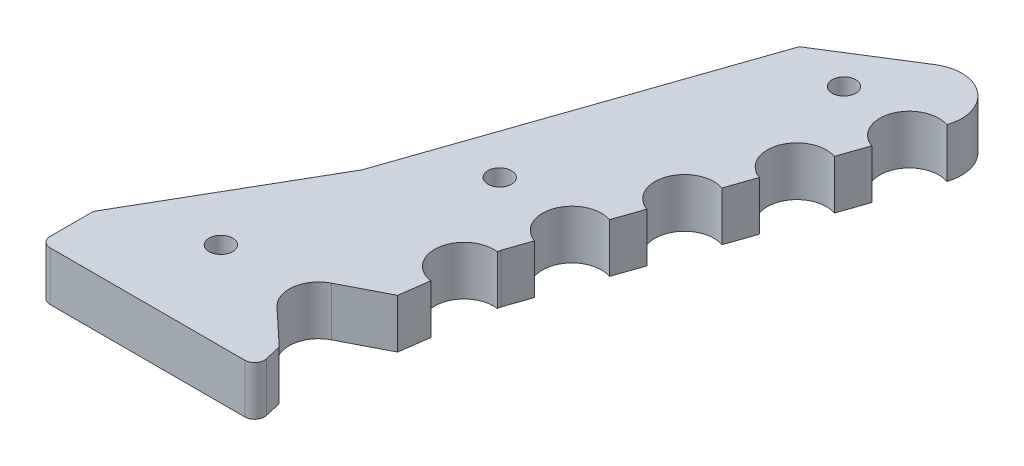
ISO-10303-21;
HEADER;
FILE_DESCRIPTION(('STEP AP214'),'2;1');
FILE_NAME('part.step','',(''),(''),'','','');
FILE_SCHEMA(('AUTOMOTIVE_DESIGN { 1 0 10303 214 1 1 1 1 }'));
ENDSEC;
DATA;
#1=APPLICATION_CONTEXT('core data for automotive mechanical design processes');
#2=APPLICATION_PROTOCOL_DEFINITION('international standard','automotive_design',2000,#1);
#3=PRODUCT_CONTEXT('',#1,'mechanical');
#4=PRODUCT('Part','Part','',(#3));
#5=PRODUCT_RELATED_PRODUCT_CATEGORY('part','',(#4));
#6=PRODUCT_DEFINITION_FORMATION('','',#4);
#7=PRODUCT_DEFINITION_CONTEXT('part definition',#1,'design');
#8=PRODUCT_DEFINITION('design','',#6,#7);
#9=PRODUCT_DEFINITION_SHAPE('','',#8);
#10=(LENGTH_UNIT() NAMED_UNIT(*) SI_UNIT(.MILLI.,.METRE.));
#11=(NAMED_UNIT(*) PLANE_ANGLE_UNIT() SI_UNIT($,.RADIAN.));
#12=(NAMED_UNIT(*) SI_UNIT($,.STERADIAN.) SOLID_ANGLE_UNIT());
#13=UNCERTAINTY_MEASURE_WITH_UNIT(LENGTH_MEASURE(1.E-05),#10,'distance_accuracy_value','');
#14=(GEOMETRIC_REPRESENTATION_CONTEXT(3) GLOBAL_UNCERTAINTY_ASSIGNED_CONTEXT((#13)) GLOBAL_UNIT_ASSIGNED_CONTEXT((#10,
#11,#12)) REPRESENTATION_CONTEXT('',''));
#15=CARTESIAN_POINT('',(0.,0.,0.));
#16=DIRECTION('',(0.,0.,1.));
#17=DIRECTION('',(1.,0.,0.));
#18=AXIS2_PLACEMENT_3D('',#15,#16,#17);
#19=CARTESIAN_POINT('',(24.1578897639016,5.,-47.3205080756888));
#20=DIRECTION('',(-0.990411286938688,0.,-0.138150217895061));
#21=DIRECTION('',(-0.138150217895061,0.,0.990411286938688));
#22=AXIS2_PLACEMENT_3D('',#19,#20,#21);
#23=PLANE('',#22);
#24=DIRECTION('',(0.138150217895061,0.,-0.990411286938688));
#25=VECTOR('',#24,1.);
#26=CARTESIAN_POINT('',(24.1578897639016,0.,-47.3205080756888));
#27=LINE('',#26,#25);
#28=CARTESIAN_POINT('',(22.8683748660811,0.,-38.0758602645134));
#29=VERTEX_POINT('',#28);
#30=CARTESIAN_POINT('',(23.2828255197663,0.,-41.0470941253295));
#31=VERTEX_POINT('',#30);
#32=EDGE_CURVE('E302',#29,#31,#27,.T.);
#33=ORIENTED_EDGE('',*,*,#32,.T.);
#34=DIRECTION('',(0.,1.,0.));
#35=VECTOR('',#34,1.);
#36=CARTESIAN_POINT('',(23.2828255197663,0.,-41.0470941253295));
#37=LINE('',#36,#35);
#38=CARTESIAN_POINT('',(23.2828255197663,5.,-41.0470941253295));
#39=VERTEX_POINT('',#38);
#40=EDGE_CURVE('E352',#31,#39,#37,.T.);
#41=ORIENTED_EDGE('',*,*,#40,.T.);
#42=DIRECTION('',(0.138150217895061,0.,-0.990411286938688));
#43=VECTOR('',#42,1.);
#44=CARTESIAN_POINT('',(24.1578897639016,5.,-47.3205080756888));
#45=LINE('',#44,#43);
#46=CARTESIAN_POINT('',(22.8683748660811,5.,-38.0758602645134));
#47=VERTEX_POINT('',#46);
#48=EDGE_CURVE('E281',#47,#39,#45,.T.);
#49=ORIENTED_EDGE('',*,*,#48,.F.);
#50=DIRECTION('',(0.,1.,0.));
#51=VECTOR('',#50,1.);
#52=CARTESIAN_POINT('',(22.8683748660811,0.,-38.0758602645134));
#53=LINE('',#52,#51);
#54=EDGE_CURVE('E362',#29,#47,#53,.T.);
#55=ORIENTED_EDGE('',*,*,#54,.F.);
#56=EDGE_LOOP('',(#33,#41,#49,#55));
#57=FACE_BOUND('',#56,.T.);
#58=ADVANCED_FACE('F34',(#57),#23,.F.);
#59=CARTESIAN_POINT('',(35.7715563017747,5.,-81.0490447646801));
#60=DIRECTION('',(-0.945518575599318,0.,-0.325568154457154));
#61=DIRECTION('',(-0.325568154457154,0.,0.945518575599318));
#62=AXIS2_PLACEMENT_3D('',#59,#60,#61);
#63=PLANE('',#62);
#64=DIRECTION('',(0.325568154457154,0.,-0.945518575599318));
#65=VECTOR('',#64,1.);
#66=CARTESIAN_POINT('',(35.7715563017747,0.,-81.0490447646801));
#67=LINE('',#66,#65);
#68=CARTESIAN_POINT('',(29.911329521546,0.,-64.0297104038924));
#69=VERTEX_POINT('',#68);
#70=CARTESIAN_POINT('',(30.8880339849174,0.,-66.8662661306903));
#71=VERTEX_POINT('',#70);
#72=EDGE_CURVE('E312',#69,#71,#67,.T.);
#73=ORIENTED_EDGE('',*,*,#72,.T.);
#74=DIRECTION('',(0.,1.,0.));
#75=VECTOR('',#74,1.);
#76=CARTESIAN_POINT('',(30.8880339849174,0.,-66.8662661306903));
#77=LINE('',#76,#75);
#78=CARTESIAN_POINT('',(30.8880339849174,5.,-66.8662661306903));
#79=VERTEX_POINT('',#78);
#80=EDGE_CURVE('E418',#71,#79,#77,.T.);
#81=ORIENTED_EDGE('',*,*,#80,.T.);
#82=DIRECTION('',(0.325568154457154,0.,-0.945518575599318));
#83=VECTOR('',#82,1.);
#84=CARTESIAN_POINT('',(35.7715563017747,5.,-81.0490447646801));
#85=LINE('',#84,#83);
#86=CARTESIAN_POINT('',(29.911329521546,5.,-64.0297104038924));
#87=VERTEX_POINT('',#86);
#88=EDGE_CURVE('E430',#87,#79,#85,.T.);
#89=ORIENTED_EDGE('',*,*,#88,.F.);
#90=DIRECTION('',(0.,1.,0.));
#91=VECTOR('',#90,1.);
#92=CARTESIAN_POINT('',(29.911329521546,0.,-64.0297104038924));
#93=LINE('',#92,#91);
#94=EDGE_CURVE('E337',#69,#87,#93,.T.);
#95=ORIENTED_EDGE('',*,*,#94,.F.);
#96=EDGE_LOOP('',(#73,#81,#89,#95));
#97=FACE_BOUND('',#96,.T.);
#98=ADVANCED_FACE('F458',(#97),#63,.F.);
#99=CARTESIAN_POINT('',(26.9812161314316,0.,-55.5200432234985));
#100=VERTEX_POINT('',#99);
#101=CARTESIAN_POINT('',(27.957920594803,0.,-58.3565989502965));
#102=VERTEX_POINT('',#101);
#103=EDGE_CURVE('E225',#100,#102,#67,.T.);
#104=ORIENTED_EDGE('',*,*,#103,.T.);
#105=DIRECTION('',(0.,1.,0.));
#106=VECTOR('',#105,1.);
#107=CARTESIAN_POINT('',(27.957920594803,0.,-58.3565989502965));
#108=LINE('',#107,#106);
#109=CARTESIAN_POINT('',(27.957920594803,5.,-58.3565989502965));
#110=VERTEX_POINT('',#109);
#111=EDGE_CURVE('E327',#102,#110,#108,.T.);
#112=ORIENTED_EDGE('',*,*,#111,.T.);
#113=CARTESIAN_POINT('',(26.9812161314316,5.,-55.5200432234985));
#114=VERTEX_POINT('',#113);
#115=EDGE_CURVE('E291',#114,#110,#85,.T.);
#116=ORIENTED_EDGE('',*,*,#115,.F.);
#117=DIRECTION('',(0.,1.,0.));
#118=VECTOR('',#117,1.);
#119=CARTESIAN_POINT('',(26.9812161314316,0.,-55.5200432234985));
#120=LINE('',#119,#118);
#121=EDGE_CURVE('E329',#100,#114,#120,.T.);
#122=ORIENTED_EDGE('',*,*,#121,.F.);
#123=EDGE_LOOP('',(#104,#112,#116,#122));
#124=FACE_BOUND('',#123,.T.);
#125=ADVANCED_FACE('F325',(#124),#63,.F.);
#126=CARTESIAN_POINT('',(24.1578897639016,0.,-47.3205080756888));
#127=VERTEX_POINT('',#126);
#128=CARTESIAN_POINT('',(25.0278072046886,0.,-49.8469317699026));
#129=VERTEX_POINT('',#128);
#130=EDGE_CURVE('E219',#127,#129,#67,.T.);
#131=ORIENTED_EDGE('',*,*,#130,.T.);
#132=DIRECTION('',(0.,1.,0.));
#133=VECTOR('',#132,1.);
#134=CARTESIAN_POINT('',(25.0278072046887,0.,-49.8469317699026));
#135=LINE('',#134,#133);
#136=CARTESIAN_POINT('',(25.0278072046887,5.,-49.8469317699026));
#137=VERTEX_POINT('',#136);
#138=EDGE_CURVE('E341',#129,#137,#135,.T.);
#139=ORIENTED_EDGE('',*,*,#138,.T.);
#140=CARTESIAN_POINT('',(24.1578897639016,5.,-47.3205080756888));
#141=VERTEX_POINT('',#140);
#142=EDGE_CURVE('E288',#141,#137,#85,.T.);
#143=ORIENTED_EDGE('',*,*,#142,.F.);
#144=DIRECTION('',(0.,-1.,0.));
#145=VECTOR('',#144,1.);
#146=CARTESIAN_POINT('',(24.1578897639016,5.,-47.3205080756888));
#147=LINE('',#146,#145);
#148=EDGE_CURVE('E210',#141,#127,#147,.T.);
#149=ORIENTED_EDGE('',*,*,#148,.T.);
#150=EDGE_LOOP('',(#131,#139,#143,#149));
#151=FACE_BOUND('',#150,.T.);
#152=ADVANCED_FACE('F441',(#151),#63,.F.);
#153=CARTESIAN_POINT('',(21.3948854060003,5.,-80.4136582216649));
#154=DIRECTION('',(0.532370499844366,0.,0.846511459399966));
#155=DIRECTION('',(0.846511459399966,0.,-0.532370499844366));
#156=AXIS2_PLACEMENT_3D('',#153,#154,#155);
#157=PLANE('',#156);
#158=DIRECTION('',(-0.846511459399966,0.,0.532370499844366));
#159=VECTOR('',#158,1.);
#160=CARTESIAN_POINT('',(21.3948854060003,0.,-80.4136582216649));
#161=LINE('',#160,#159);
#162=CARTESIAN_POINT('',(29.86,0.,-85.7373632201086));
#163=VERTEX_POINT('',#162);
#164=CARTESIAN_POINT('',(21.3948854060003,0.,-80.4136582216649));
#165=VERTEX_POINT('',#164);
#166=EDGE_CURVE('E217',#163,#165,#161,.T.);
#167=ORIENTED_EDGE('',*,*,#166,.T.);
#168=DIRECTION('',(0.,-1.,0.));
#169=VECTOR('',#168,1.);
#170=CARTESIAN_POINT('',(21.3948854060003,5.,-80.4136582216649));
#171=LINE('',#170,#169);
#172=CARTESIAN_POINT('',(21.3948854060003,5.,-80.4136582216649));
#173=VERTEX_POINT('',#172);
#174=EDGE_CURVE('E242',#173,#165,#171,.T.);
#175=ORIENTED_EDGE('',*,*,#174,.F.);
#176=DIRECTION('',(-0.846511459399966,0.,0.532370499844366));
#177=VECTOR('',#176,1.);
#178=CARTESIAN_POINT('',(21.3948854060003,5.,-80.4136582216649));
#179=LINE('',#178,#177);
#180=CARTESIAN_POINT('',(29.86,5.,-85.7373632201086));
#181=VERTEX_POINT('',#180);
#182=EDGE_CURVE('E218',#181,#173,#179,.T.);
#183=ORIENTED_EDGE('',*,*,#182,.F.);
#184=DIRECTION('',(0.,-1.,0.));
#185=VECTOR('',#184,1.);
#186=CARTESIAN_POINT('',(29.86,5.,-85.7373632201086));
#187=LINE('',#186,#185);
#188=EDGE_CURVE('E211',#181,#163,#187,.T.);
#189=ORIENTED_EDGE('',*,*,#188,.T.);
#190=EDGE_LOOP('',(#167,#175,#183,#189));
#191=FACE_BOUND('',#190,.T.);
#192=ADVANCED_FACE('F480',(#191),#157,.F.);
#193=CARTESIAN_POINT('',(9.99999999999996,5.,-47.3205080756888));
#194=DIRECTION('',(0.945518575599318,0.,0.325568154457154));
#195=DIRECTION('',(0.325568154457154,0.,-0.945518575599318));
#196=AXIS2_PLACEMENT_3D('',#193,#194,#195);
#197=PLANE('',#196);
#198=DIRECTION('',(-0.325568154457154,0.,0.945518575599318));
#199=VECTOR('',#198,1.);
#200=CARTESIAN_POINT('',(9.99999999999996,0.,-47.3205080756888));
#201=LINE('',#200,#199);
#202=CARTESIAN_POINT('',(9.99999999999996,0.,-47.3205080756888));
#203=VERTEX_POINT('',#202);
#204=EDGE_CURVE('E295',#165,#203,#201,.T.);
#205=ORIENTED_EDGE('',*,*,#204,.T.);
#206=DIRECTION('',(0.,-1.,0.));
#207=VECTOR('',#206,1.);
#208=CARTESIAN_POINT('',(9.99999999999996,5.,-47.3205080756888));
#209=LINE('',#208,#207);
#210=CARTESIAN_POINT('',(9.99999999999996,5.,-47.3205080756888));
#211=VERTEX_POINT('',#210);
#212=EDGE_CURVE('E239',#211,#203,#209,.T.);
#213=ORIENTED_EDGE('',*,*,#212,.F.);
#214=DIRECTION('',(-0.325568154457154,0.,0.945518575599318));
#215=VECTOR('',#214,1.);
#216=CARTESIAN_POINT('',(9.99999999999996,5.,-47.3205080756888));
#217=LINE('',#216,#215);
#218=EDGE_CURVE('E222',#173,#211,#217,.T.);
#219=ORIENTED_EDGE('',*,*,#218,.F.);
#220=ORIENTED_EDGE('',*,*,#174,.T.);
#221=EDGE_LOOP('',(#205,#213,#219,#220));
#222=FACE_BOUND('',#221,.T.);
#223=ADVANCED_FACE('F477',(#222),#197,.F.);
#224=CARTESIAN_POINT('',(0.,5.,-30.));
#225=DIRECTION('',(0.86602540378444,0.,0.499999999999998));
#226=DIRECTION('',(0.499999999999998,0.,-0.86602540378444));
#227=AXIS2_PLACEMENT_3D('',#224,#225,#226);
#228=PLANE('',#227);
#229=DIRECTION('',(-0.499999999999998,0.,0.86602540378444));
#230=VECTOR('',#229,1.);
#231=CARTESIAN_POINT('',(0.,0.,-30.));
#232=LINE('',#231,#230);
#233=CARTESIAN_POINT('',(0.,0.,-30.));
#234=VERTEX_POINT('',#233);
#235=EDGE_CURVE('E297',#203,#234,#232,.T.);
#236=ORIENTED_EDGE('',*,*,#235,.T.);
#237=DIRECTION('',(0.,-1.,0.));
#238=VECTOR('',#237,1.);
#239=CARTESIAN_POINT('',(0.,5.,-30.));
#240=LINE('',#239,#238);
#241=CARTESIAN_POINT('',(0.,5.,-30.));
#242=VERTEX_POINT('',#241);
#243=EDGE_CURVE('E236',#242,#234,#240,.T.);
#244=ORIENTED_EDGE('',*,*,#243,.F.);
#245=DIRECTION('',(-0.499999999999998,0.,0.86602540378444));
#246=VECTOR('',#245,1.);
#247=CARTESIAN_POINT('',(0.,5.,-30.));
#248=LINE('',#247,#246);
#249=EDGE_CURVE('E284',#211,#242,#248,.T.);
#250=ORIENTED_EDGE('',*,*,#249,.F.);
#251=ORIENTED_EDGE('',*,*,#212,.T.);
#252=EDGE_LOOP('',(#236,#244,#250,#251));
#253=FACE_BOUND('',#252,.T.);
#254=ADVANCED_FACE('F393',(#253),#228,.F.);
#255=CARTESIAN_POINT('',(0.,5.,0.));
#256=DIRECTION('',(1.,0.,0.));
#257=DIRECTION('',(0.,0.,-1.));
#258=AXIS2_PLACEMENT_3D('',#255,#256,#257);
#259=PLANE('',#258);
#260=DIRECTION('',(0.,0.,1.));
#261=VECTOR('',#260,1.);
#262=CARTESIAN_POINT('',(0.,0.,0.));
#263=LINE('',#262,#261);
#264=CARTESIAN_POINT('',(0.,0.,-25.5883219764711));
#265=VERTEX_POINT('',#264);
#266=EDGE_CURVE('E299',#234,#265,#263,.T.);
#267=ORIENTED_EDGE('',*,*,#266,.T.);
#268=DIRECTION('',(0.,1.,0.));
#269=VECTOR('',#268,1.);
#270=CARTESIAN_POINT('',(0.,5.,-25.5883219764711));
#271=LINE('',#270,#269);
#272=CARTESIAN_POINT('',(0.,5.,-25.5883219764711));
#273=VERTEX_POINT('',#272);
#274=EDGE_CURVE('E11',#265,#273,#271,.T.);
#275=ORIENTED_EDGE('',*,*,#274,.T.);
#276=DIRECTION('',(0.,0.,1.));
#277=VECTOR('',#276,1.);
#278=CARTESIAN_POINT('',(0.,5.,0.));
#279=LINE('',#278,#277);
#280=EDGE_CURVE('E279',#242,#273,#279,.T.);
#281=ORIENTED_EDGE('',*,*,#280,.F.);
#282=ORIENTED_EDGE('',*,*,#243,.T.);
#283=EDGE_LOOP('',(#267,#275,#281,#282));
#284=FACE_BOUND('',#283,.T.);
#285=ADVANCED_FACE('F396',(#284),#259,.F.);
#286=CARTESIAN_POINT('',(21.3948854060003,5.,-27.512282336915));
#287=DIRECTION('',(-0.974653453481312,0.,0.223720016129428));
#288=DIRECTION('',(0.223720016129428,0.,0.974653453481312));
#289=AXIS2_PLACEMENT_3D('',#286,#287,#288);
#290=PLANE('',#289);
#291=DIRECTION('',(-0.223720016129428,0.,-0.974653453481312));
#292=VECTOR('',#291,1.);
#293=CARTESIAN_POINT('',(21.3948854060003,5.,-27.512282336915));
#294=LINE('',#293,#292);
#295=CARTESIAN_POINT('',(21.785155194606,5.,-25.8120419926005));
#296=VERTEX_POINT('',#295);
#297=CARTESIAN_POINT('',(21.3948854060003,5.,-27.512282336915));
#298=VERTEX_POINT('',#297);
#299=EDGE_CURVE('E274',#296,#298,#294,.T.);
#300=ORIENTED_EDGE('',*,*,#299,.F.);
#301=DIRECTION('',(0.,1.,0.));
#302=VECTOR('',#301,1.);
#303=CARTESIAN_POINT('',(21.785155194606,5.,-25.8120419926005));
#304=LINE('',#303,#302);
#305=CARTESIAN_POINT('',(21.785155194606,0.,-25.8120419926005));
#306=VERTEX_POINT('',#305);
#307=EDGE_CURVE('E57',#296,#306,#304,.F.);
#308=ORIENTED_EDGE('',*,*,#307,.T.);
#309=DIRECTION('',(-0.223720016129428,0.,-0.974653453481312));
#310=VECTOR('',#309,1.);
#311=CARTESIAN_POINT('',(21.3948854060003,0.,-27.512282336915));
#312=LINE('',#311,#310);
#313=CARTESIAN_POINT('',(21.3948854060003,0.,-27.512282336915));
#314=VERTEX_POINT('',#313);
#315=EDGE_CURVE('E259',#306,#314,#312,.T.);
#316=ORIENTED_EDGE('',*,*,#315,.T.);
#317=DIRECTION('',(0.,-1.,0.));
#318=VECTOR('',#317,1.);
#319=CARTESIAN_POINT('',(21.3948854060003,5.,-27.512282336915));
#320=LINE('',#319,#318);
#321=EDGE_CURVE('E233',#298,#314,#320,.T.);
#322=ORIENTED_EDGE('',*,*,#321,.F.);
#323=EDGE_LOOP('',(#300,#308,#316,#322));
#324=FACE_BOUND('',#323,.T.);
#325=ADVANCED_FACE('F277',(#324),#290,.F.);
#326=CARTESIAN_POINT('',(24.1117268271366,5.,-46.9895618469616));
#327=VERTEX_POINT('',#326);
#328=EDGE_CURVE('E278',#327,#141,#45,.T.);
#329=ORIENTED_EDGE('',*,*,#328,.F.);
#330=DIRECTION('',(0.,1.,0.));
#331=VECTOR('',#330,1.);
#332=CARTESIAN_POINT('',(24.1117268271366,0.,-46.9895618469616));
#333=LINE('',#332,#331);
#334=CARTESIAN_POINT('',(24.1117268271366,0.,-46.9895618469616));
#335=VERTEX_POINT('',#334);
#336=EDGE_CURVE('E359',#335,#327,#333,.T.);
#337=ORIENTED_EDGE('',*,*,#336,.F.);
#338=EDGE_CURVE('E301',#335,#127,#27,.T.);
#339=ORIENTED_EDGE('',*,*,#338,.T.);
#340=ORIENTED_EDGE('',*,*,#148,.F.);
#341=EDGE_LOOP('',(#329,#337,#339,#340));
#342=FACE_BOUND('',#341,.T.);
#343=ADVANCED_FACE('F443',(#342),#23,.F.);
#344=CARTESIAN_POINT('',(32.8414429116603,0.,-72.5393775842862));
#345=VERTEX_POINT('',#344);
#346=CARTESIAN_POINT('',(33.8181473750318,0.,-75.3759333110842));
#347=VERTEX_POINT('',#346);
#348=EDGE_CURVE('E227',#345,#347,#67,.T.);
#349=ORIENTED_EDGE('',*,*,#348,.T.);
#350=DIRECTION('',(0.,1.,0.));
#351=VECTOR('',#350,1.);
#352=CARTESIAN_POINT('',(33.8181473750318,0.,-75.3759333110842));
#353=LINE('',#352,#351);
#354=CARTESIAN_POINT('',(33.8181473750318,5.,-75.3759333110842));
#355=VERTEX_POINT('',#354);
#356=EDGE_CURVE('E197',#347,#355,#353,.T.);
#357=ORIENTED_EDGE('',*,*,#356,.T.);
#358=CARTESIAN_POINT('',(32.8414429116603,5.,-72.5393775842862));
#359=VERTEX_POINT('',#358);
#360=EDGE_CURVE('E292',#359,#355,#85,.T.);
#361=ORIENTED_EDGE('',*,*,#360,.F.);
#362=DIRECTION('',(0.,1.,0.));
#363=VECTOR('',#362,1.);
#364=CARTESIAN_POINT('',(32.8414429116603,0.,-72.5393775842862));
#365=LINE('',#364,#363);
#366=EDGE_CURVE('E344',#345,#359,#365,.T.);
#367=ORIENTED_EDGE('',*,*,#366,.F.);
#368=EDGE_LOOP('',(#349,#357,#361,#367));
#369=FACE_BOUND('',#368,.T.);
#370=ADVANCED_FACE('F431',(#369),#63,.F.);
#371=CARTESIAN_POINT('',(31.9894819993774,5.,-82.3513173825088));
#372=DIRECTION('',(0.,-1.,0.));
#373=DIRECTION('',(0.,0.,-1.));
#374=AXIS2_PLACEMENT_3D('',#371,#372,#373);
#375=CYLINDRICAL_SURFACE('',#374,3.99999999999999);
#376=CARTESIAN_POINT('',(31.9894819993774,0.,-82.3513173825088));
#377=DIRECTION('',(0.,1.,0.));
#378=DIRECTION('',(0.,0.,-1.));
#379=AXIS2_PLACEMENT_3D('',#376,#377,#378);
#380=CIRCLE('',#379,3.99999999999999);
#381=CARTESIAN_POINT('',(35.7715563017747,0.,-81.0490447646801));
#382=VERTEX_POINT('',#381);
#383=EDGE_CURVE('E207',#382,#163,#380,.T.);
#384=ORIENTED_EDGE('',*,*,#383,.T.);
#385=ORIENTED_EDGE('',*,*,#188,.F.);
#386=CARTESIAN_POINT('',(31.9894819993774,5.,-82.3513173825088));
#387=DIRECTION('',(0.,1.,0.));
#388=DIRECTION('',(0.,0.,-1.));
#389=AXIS2_PLACEMENT_3D('',#386,#387,#388);
#390=CIRCLE('',#389,3.99999999999999);
#391=CARTESIAN_POINT('',(35.7715563017747,5.,-81.0490447646801));
#392=VERTEX_POINT('',#391);
#393=EDGE_CURVE('E209',#392,#181,#390,.T.);
#394=ORIENTED_EDGE('',*,*,#393,.F.);
#395=DIRECTION('',(0.,-1.,0.));
#396=VECTOR('',#395,1.);
#397=CARTESIAN_POINT('',(35.7715563017747,5.,-81.0490447646801));
#398=LINE('',#397,#396);
#399=EDGE_CURVE('E194',#392,#382,#398,.T.);
#400=ORIENTED_EDGE('',*,*,#399,.T.);
#401=EDGE_LOOP('',(#384,#385,#394,#400));
#402=FACE_BOUND('',#401,.T.);
#403=ADVANCED_FACE('F205',(#402),#375,.T.);
#404=CARTESIAN_POINT('',(31.9894819993774,5.,-82.3513173825088));
#405=DIRECTION('',(0.,-1.,0.));
#406=DIRECTION('',(0.,0.,-1.));
#407=AXIS2_PLACEMENT_3D('',#404,#405,#406);
#408=PLANE('',#407);
#409=CARTESIAN_POINT('',(9.43278631160015,5.,-33.5342728019948));
#410=DIRECTION('',(0.,1.,0.));
#411=DIRECTION('',(0.,0.,1.));
#412=AXIS2_PLACEMENT_3D('',#409,#410,#411);
#413=CIRCLE('',#412,1.2);
#414=CARTESIAN_POINT('',(9.43278631160015,5.,-32.3342728019948));
#415=VERTEX_POINT('',#414);
#416=EDGE_CURVE('E380',#415,#415,#413,.T.);
#417=ORIENTED_EDGE('',*,*,#416,.F.);
#418=EDGE_LOOP('',(#417));
#419=FACE_BOUND('',#418,.T.);
#420=CARTESIAN_POINT('',(17.6754420810914,5.,-53.660191960072));
#421=DIRECTION('',(0.,1.,0.));
#422=DIRECTION('',(0.,0.,1.));
#423=AXIS2_PLACEMENT_3D('',#420,#421,#422);
#424=CIRCLE('',#423,1.2);
#425=CARTESIAN_POINT('',(17.6754420810914,5.,-52.460191960072));
#426=VERTEX_POINT('',#425);
#427=EDGE_CURVE('E406',#426,#426,#424,.T.);
#428=ORIENTED_EDGE('',*,*,#427,.F.);
#429=EDGE_LOOP('',(#428));
#430=FACE_BOUND('',#429,.T.);
#431=CARTESIAN_POINT('',(27.1732683912637,5.,-79.1891935012536));
#432=DIRECTION('',(0.,1.,0.));
#433=DIRECTION('',(0.,0.,1.));
#434=AXIS2_PLACEMENT_3D('',#431,#432,#433);
#435=CIRCLE('',#434,1.2);
#436=CARTESIAN_POINT('',(27.1732683912637,5.,-77.9891935012536));
#437=VERTEX_POINT('',#436);
#438=EDGE_CURVE('E412',#437,#437,#435,.T.);
#439=ORIENTED_EDGE('',*,*,#438,.F.);
#440=EDGE_LOOP('',(#439));
#441=FACE_BOUND('',#440,.T.);
#442=DIRECTION('',(-1.,0.,0.));
#443=VECTOR('',#442,1.);
#444=CARTESIAN_POINT('',(22.0660454543886,5.,-24.5883219764711));
#445=LINE('',#444,#443);
#446=CARTESIAN_POINT('',(20.8105017411247,5.,-24.5883219764711));
#447=VERTEX_POINT('',#446);
#448=CARTESIAN_POINT('',(1.,5.,-24.5883219764711));
#449=VERTEX_POINT('',#448);
#450=EDGE_CURVE('E268',#447,#449,#445,.T.);
#451=ORIENTED_EDGE('',*,*,#450,.F.);
#452=CARTESIAN_POINT('',(20.8105017411247,5.,-25.5883219764711));
#453=DIRECTION('',(0.,-1.,0.));
#454=DIRECTION('',(0.,0.,-1.));
#455=AXIS2_PLACEMENT_3D('',#452,#453,#454);
#456=CIRCLE('',#455,1.);
#457=EDGE_CURVE('E252',#447,#296,#456,.F.);
#458=ORIENTED_EDGE('',*,*,#457,.T.);
#459=ORIENTED_EDGE('',*,*,#299,.T.);
#460=DIRECTION('',(-0.72987002388853,0.,-0.6835859479458));
#461=VECTOR('',#460,1.);
#462=CARTESIAN_POINT('',(23.7242831618267,5.,-25.3306013239371));
#463=LINE('',#462,#461);
#464=CARTESIAN_POINT('',(17.7455352865577,5.,-30.930212076644));
#465=VERTEX_POINT('',#464);
#466=EDGE_CURVE('E369',#298,#465,#463,.T.);
#467=ORIENTED_EDGE('',*,*,#466,.T.);
#468=CARTESIAN_POINT('',(19.7962931303951,5.,-33.1198221483096));
#469=DIRECTION('',(0.,1.,0.));
#470=DIRECTION('',(0.,0.,1.));
#471=AXIS2_PLACEMENT_3D('',#468,#469,#470);
#472=CIRCLE('',#471,3.);
#473=CARTESIAN_POINT('',(18.4230038326927,5.,-35.7870447683427));
#474=VERTEX_POINT('',#473);
#475=EDGE_CURVE('E379',#474,#465,#472,.T.);
#476=ORIENTED_EDGE('',*,*,#475,.F.);
#477=DIRECTION('',(-0.889074206677684,0.,0.457763099234143));
#478=VECTOR('',#477,1.);
#479=CARTESIAN_POINT('',(-10.7043172544185,5.,-20.7900820029413));
#480=LINE('',#479,#478);
#481=EDGE_CURVE('E376',#47,#474,#480,.T.);
#482=ORIENTED_EDGE('',*,*,#481,.F.);
#483=ORIENTED_EDGE('',*,*,#48,.T.);
#484=CARTESIAN_POINT('',(23.6972761734514,5.,-44.0183279861455));
#485=DIRECTION('',(0.,1.,0.));
#486=DIRECTION('',(0.,0.,1.));
#487=AXIS2_PLACEMENT_3D('',#484,#485,#486);
#488=CIRCLE('',#487,3.);
#489=EDGE_CURVE('E360',#327,#39,#488,.T.);
#490=ORIENTED_EDGE('',*,*,#489,.F.);
#491=ORIENTED_EDGE('',*,*,#328,.T.);
#492=ORIENTED_EDGE('',*,*,#142,.T.);
#493=CARTESIAN_POINT('',(26.0045116680601,5.,-52.6834874967006));
#494=DIRECTION('',(0.,1.,0.));
#495=DIRECTION('',(0.,0.,1.));
#496=AXIS2_PLACEMENT_3D('',#493,#494,#495);
#497=CIRCLE('',#496,3.);
#498=EDGE_CURVE('E350',#114,#137,#497,.T.);
#499=ORIENTED_EDGE('',*,*,#498,.F.);
#500=ORIENTED_EDGE('',*,*,#115,.T.);
#501=CARTESIAN_POINT('',(28.9346250581745,5.,-61.1931546770944));
#502=DIRECTION('',(0.,1.,0.));
#503=DIRECTION('',(0.,0.,1.));
#504=AXIS2_PLACEMENT_3D('',#501,#502,#503);
#505=CIRCLE('',#504,3.);
#506=EDGE_CURVE('E338',#87,#110,#505,.T.);
#507=ORIENTED_EDGE('',*,*,#506,.F.);
#508=ORIENTED_EDGE('',*,*,#88,.T.);
#509=CARTESIAN_POINT('',(31.8647384482889,5.,-69.7028218574883));
#510=DIRECTION('',(0.,1.,0.));
#511=DIRECTION('',(0.,0.,1.));
#512=AXIS2_PLACEMENT_3D('',#509,#510,#511);
#513=CIRCLE('',#512,3.00000000000001);
#514=EDGE_CURVE('E347',#359,#79,#513,.T.);
#515=ORIENTED_EDGE('',*,*,#514,.F.);
#516=ORIENTED_EDGE('',*,*,#360,.T.);
#517=CARTESIAN_POINT('',(34.7948518384033,5.,-78.2124890378822));
#518=DIRECTION('',(0.,1.,0.));
#519=DIRECTION('',(0.,0.,1.));
#520=AXIS2_PLACEMENT_3D('',#517,#518,#519);
#521=CIRCLE('',#520,3.00000000000001);
#522=EDGE_CURVE('E201',#392,#355,#521,.T.);
#523=ORIENTED_EDGE('',*,*,#522,.F.);
#524=ORIENTED_EDGE('',*,*,#393,.T.);
#525=ORIENTED_EDGE('',*,*,#182,.T.);
#526=ORIENTED_EDGE('',*,*,#218,.T.);
#527=ORIENTED_EDGE('',*,*,#249,.T.);
#528=ORIENTED_EDGE('',*,*,#280,.T.);
#529=CARTESIAN_POINT('',(1.,5.,-25.5883219764711));
#530=DIRECTION('',(0.,-1.,0.));
#531=DIRECTION('',(0.,0.,-1.));
#532=AXIS2_PLACEMENT_3D('',#529,#530,#531);
#533=CIRCLE('',#532,1.);
#534=EDGE_CURVE('E250',#273,#449,#533,.F.);
#535=ORIENTED_EDGE('',*,*,#534,.T.);
#536=EDGE_LOOP('',(#451,#458,#459,#467,#476,#482,#483,#490,#491,#492,#499,#500,#507,#508,#515,
#516,#523,#524,#525,#526,#527,#528,#535));
#537=FACE_BOUND('',#536,.T.);
#538=ADVANCED_FACE('F272',(#419,#430,#441,#537),#408,.F.);
#539=CARTESIAN_POINT('',(31.9894819993774,0.,-82.3513173825088));
#540=DIRECTION('',(0.,-1.,0.));
#541=DIRECTION('',(0.,0.,-1.));
#542=AXIS2_PLACEMENT_3D('',#539,#540,#541);
#543=PLANE('',#542);
#544=ORIENTED_EDGE('',*,*,#315,.F.);
#545=CARTESIAN_POINT('',(20.8105017411247,0.,-25.5883219764711));
#546=DIRECTION('',(0.,-1.,0.));
#547=DIRECTION('',(0.,0.,-1.));
#548=AXIS2_PLACEMENT_3D('',#545,#546,#547);
#549=CIRCLE('',#548,1.);
#550=CARTESIAN_POINT('',(20.8105017411247,0.,-24.5883219764711));
#551=VERTEX_POINT('',#550);
#552=EDGE_CURVE('E42',#306,#551,#549,.T.);
#553=ORIENTED_EDGE('',*,*,#552,.T.);
#554=DIRECTION('',(-1.,0.,0.));
#555=VECTOR('',#554,1.);
#556=CARTESIAN_POINT('',(28.6147132621544,0.,-24.5883219764711));
#557=LINE('',#556,#555);
#558=CARTESIAN_POINT('',(1.,0.,-24.5883219764711));
#559=VERTEX_POINT('',#558);
#560=EDGE_CURVE('E257',#551,#559,#557,.T.);
#561=ORIENTED_EDGE('',*,*,#560,.T.);
#562=CARTESIAN_POINT('',(1.,0.,-25.5883219764711));
#563=DIRECTION('',(0.,-1.,0.));
#564=DIRECTION('',(0.,0.,-1.));
#565=AXIS2_PLACEMENT_3D('',#562,#563,#564);
#566=CIRCLE('',#565,1.);
#567=EDGE_CURVE('E49',#559,#265,#566,.T.);
#568=ORIENTED_EDGE('',*,*,#567,.T.);
#569=ORIENTED_EDGE('',*,*,#266,.F.);
#570=ORIENTED_EDGE('',*,*,#235,.F.);
#571=ORIENTED_EDGE('',*,*,#204,.F.);
#572=ORIENTED_EDGE('',*,*,#166,.F.);
#573=ORIENTED_EDGE('',*,*,#383,.F.);
#574=CARTESIAN_POINT('',(34.7948518384033,0.,-78.2124890378822));
#575=DIRECTION('',(0.,1.,0.));
#576=DIRECTION('',(0.,0.,1.));
#577=AXIS2_PLACEMENT_3D('',#574,#575,#576);
#578=CIRCLE('',#577,3.00000000000001);
#579=EDGE_CURVE('E191',#382,#347,#578,.T.);
#580=ORIENTED_EDGE('',*,*,#579,.T.);
#581=ORIENTED_EDGE('',*,*,#348,.F.);
#582=CARTESIAN_POINT('',(31.8647384482889,0.,-69.7028218574883));
#583=DIRECTION('',(0.,1.,0.));
#584=DIRECTION('',(0.,0.,1.));
#585=AXIS2_PLACEMENT_3D('',#582,#583,#584);
#586=CIRCLE('',#585,3.00000000000001);
#587=EDGE_CURVE('E420',#345,#71,#586,.T.);
#588=ORIENTED_EDGE('',*,*,#587,.T.);
#589=ORIENTED_EDGE('',*,*,#72,.F.);
#590=CARTESIAN_POINT('',(28.9346250581745,0.,-61.1931546770944));
#591=DIRECTION('',(0.,1.,0.));
#592=DIRECTION('',(0.,0.,1.));
#593=AXIS2_PLACEMENT_3D('',#590,#591,#592);
#594=CIRCLE('',#593,3.);
#595=EDGE_CURVE('E334',#69,#102,#594,.T.);
#596=ORIENTED_EDGE('',*,*,#595,.T.);
#597=ORIENTED_EDGE('',*,*,#103,.F.);
#598=CARTESIAN_POINT('',(26.0045116680601,0.,-52.6834874967006));
#599=DIRECTION('',(0.,1.,0.));
#600=DIRECTION('',(0.,0.,1.));
#601=AXIS2_PLACEMENT_3D('',#598,#599,#600);
#602=CIRCLE('',#601,3.);
#603=EDGE_CURVE('E333',#100,#129,#602,.T.);
#604=ORIENTED_EDGE('',*,*,#603,.T.);
#605=ORIENTED_EDGE('',*,*,#130,.F.);
#606=ORIENTED_EDGE('',*,*,#338,.F.);
#607=CARTESIAN_POINT('',(23.6972761734514,0.,-44.0183279861455));
#608=DIRECTION('',(0.,1.,0.));
#609=DIRECTION('',(0.,0.,1.));
#610=AXIS2_PLACEMENT_3D('',#607,#608,#609);
#611=CIRCLE('',#610,3.);
#612=EDGE_CURVE('E356',#335,#31,#611,.T.);
#613=ORIENTED_EDGE('',*,*,#612,.T.);
#614=ORIENTED_EDGE('',*,*,#32,.F.);
#615=DIRECTION('',(-0.889074206677684,0.,0.457763099234143));
#616=VECTOR('',#615,1.);
#617=CARTESIAN_POINT('',(-10.7043172544185,0.,-20.7900820029413));
#618=LINE('',#617,#616);
#619=CARTESIAN_POINT('',(18.4230038326927,0.,-35.7870447683427));
#620=VERTEX_POINT('',#619);
#621=EDGE_CURVE('E365',#29,#620,#618,.T.);
#622=ORIENTED_EDGE('',*,*,#621,.T.);
#623=CARTESIAN_POINT('',(19.7962931303951,0.,-33.1198221483096));
#624=DIRECTION('',(0.,1.,0.));
#625=DIRECTION('',(0.,0.,1.));
#626=AXIS2_PLACEMENT_3D('',#623,#624,#625);
#627=CIRCLE('',#626,3.);
#628=CARTESIAN_POINT('',(17.7455352865577,0.,-30.9302120766441));
#629=VERTEX_POINT('',#628);
#630=EDGE_CURVE('E368',#620,#629,#627,.T.);
#631=ORIENTED_EDGE('',*,*,#630,.T.);
#632=DIRECTION('',(-0.72987002388853,0.,-0.6835859479458));
#633=VECTOR('',#632,1.);
#634=CARTESIAN_POINT('',(23.7242831618267,0.,-25.3306013239371));
#635=LINE('',#634,#633);
#636=EDGE_CURVE('E372',#314,#629,#635,.T.);
#637=ORIENTED_EDGE('',*,*,#636,.F.);
#638=EDGE_LOOP('',(#544,#553,#561,#568,#569,#570,#571,#572,#573,#580,#581,#588,#589,#596,#597,
#604,#605,#606,#613,#614,#622,#631,#637));
#639=FACE_BOUND('',#638,.T.);
#640=CARTESIAN_POINT('',(9.43278631160015,0.,-33.5342728019948));
#641=DIRECTION('',(0.,1.,0.));
#642=DIRECTION('',(0.,0.,1.));
#643=AXIS2_PLACEMENT_3D('',#640,#641,#642);
#644=CIRCLE('',#643,1.2);
#645=CARTESIAN_POINT('',(9.43278631160015,0.,-32.3342728019948));
#646=VERTEX_POINT('',#645);
#647=EDGE_CURVE('E403',#646,#646,#644,.T.);
#648=ORIENTED_EDGE('',*,*,#647,.T.);
#649=EDGE_LOOP('',(#648));
#650=FACE_BOUND('',#649,.T.);
#651=CARTESIAN_POINT('',(17.6754420810914,0.,-53.660191960072));
#652=DIRECTION('',(0.,1.,0.));
#653=DIRECTION('',(0.,0.,1.));
#654=AXIS2_PLACEMENT_3D('',#651,#652,#653);
#655=CIRCLE('',#654,1.2);
#656=CARTESIAN_POINT('',(17.6754420810914,0.,-52.460191960072));
#657=VERTEX_POINT('',#656);
#658=EDGE_CURVE('E409',#657,#657,#655,.T.);
#659=ORIENTED_EDGE('',*,*,#658,.T.);
#660=EDGE_LOOP('',(#659));
#661=FACE_BOUND('',#660,.T.);
#662=CARTESIAN_POINT('',(27.1732683912637,0.,-79.1891935012536));
#663=DIRECTION('',(0.,1.,0.));
#664=DIRECTION('',(0.,0.,1.));
#665=AXIS2_PLACEMENT_3D('',#662,#663,#664);
#666=CIRCLE('',#665,1.2);
#667=CARTESIAN_POINT('',(27.1732683912637,0.,-77.9891935012536));
#668=VERTEX_POINT('',#667);
#669=EDGE_CURVE('E267',#668,#668,#666,.T.);
#670=ORIENTED_EDGE('',*,*,#669,.T.);
#671=EDGE_LOOP('',(#670));
#672=FACE_BOUND('',#671,.T.);
#673=ADVANCED_FACE('F214',(#639,#650,#661,#672),#543,.T.);
#674=CARTESIAN_POINT('',(-10.7043172544185,0.,-20.7900820029413));
#675=DIRECTION('',(-0.457763099234143,0.,-0.889074206677684));
#676=DIRECTION('',(-0.889074206677684,0.,0.457763099234143));
#677=AXIS2_PLACEMENT_3D('',#674,#675,#676);
#678=PLANE('',#677);
#679=ORIENTED_EDGE('',*,*,#481,.T.);
#680=DIRECTION('',(0.,1.,0.));
#681=VECTOR('',#680,1.);
#682=CARTESIAN_POINT('',(18.4230038326927,0.,-35.7870447683427));
#683=LINE('',#682,#681);
#684=EDGE_CURVE('E375',#620,#474,#683,.T.);
#685=ORIENTED_EDGE('',*,*,#684,.F.);
#686=ORIENTED_EDGE('',*,*,#621,.F.);
#687=ORIENTED_EDGE('',*,*,#54,.T.);
#688=EDGE_LOOP('',(#679,#685,#686,#687));
#689=FACE_BOUND('',#688,.T.);
#690=ADVANCED_FACE('F560',(#689),#678,.F.);
#691=CARTESIAN_POINT('',(23.7242831618267,0.,-25.3306013239371));
#692=DIRECTION('',(0.6835859479458,0.,-0.72987002388853));
#693=DIRECTION('',(-0.72987002388853,0.,-0.6835859479458));
#694=AXIS2_PLACEMENT_3D('',#691,#692,#693);
#695=PLANE('',#694);
#696=ORIENTED_EDGE('',*,*,#466,.F.);
#697=ORIENTED_EDGE('',*,*,#321,.T.);
#698=ORIENTED_EDGE('',*,*,#636,.T.);
#699=DIRECTION('',(0.,1.,0.));
#700=VECTOR('',#699,1.);
#701=CARTESIAN_POINT('',(17.7455352865577,0.,-30.930212076644));
#702=LINE('',#701,#700);
#703=EDGE_CURVE('E385',#629,#465,#702,.T.);
#704=ORIENTED_EDGE('',*,*,#703,.T.);
#705=EDGE_LOOP('',(#696,#697,#698,#704));
#706=FACE_BOUND('',#705,.T.);
#707=ADVANCED_FACE('F586',(#706),#695,.T.);
#708=CARTESIAN_POINT('',(19.7962931303951,0.,-33.1198221483096));
#709=DIRECTION('',(0.,1.,0.));
#710=DIRECTION('',(0.,0.,1.));
#711=AXIS2_PLACEMENT_3D('',#708,#709,#710);
#712=CYLINDRICAL_SURFACE('',#711,3.);
#713=ORIENTED_EDGE('',*,*,#475,.T.);
#714=ORIENTED_EDGE('',*,*,#703,.F.);
#715=ORIENTED_EDGE('',*,*,#630,.F.);
#716=ORIENTED_EDGE('',*,*,#684,.T.);
#717=EDGE_LOOP('',(#713,#714,#715,#716));
#718=FACE_BOUND('',#717,.T.);
#719=ADVANCED_FACE('F455',(#718),#712,.F.);
#720=CARTESIAN_POINT('',(23.6972761734514,0.,-44.0183279861455));
#721=DIRECTION('',(0.,1.,0.));
#722=DIRECTION('',(0.,0.,1.));
#723=AXIS2_PLACEMENT_3D('',#720,#721,#722);
#724=CYLINDRICAL_SURFACE('',#723,3.);
#725=ORIENTED_EDGE('',*,*,#489,.T.);
#726=ORIENTED_EDGE('',*,*,#40,.F.);
#727=ORIENTED_EDGE('',*,*,#612,.F.);
#728=ORIENTED_EDGE('',*,*,#336,.T.);
#729=EDGE_LOOP('',(#725,#726,#727,#728));
#730=FACE_BOUND('',#729,.T.);
#731=ADVANCED_FACE('F439',(#730),#724,.F.);
#732=CARTESIAN_POINT('',(26.0045116680601,0.,-52.6834874967006));
#733=DIRECTION('',(0.,1.,0.));
#734=DIRECTION('',(0.,0.,1.));
#735=AXIS2_PLACEMENT_3D('',#732,#733,#734);
#736=CYLINDRICAL_SURFACE('',#735,3.);
#737=ORIENTED_EDGE('',*,*,#498,.T.);
#738=ORIENTED_EDGE('',*,*,#138,.F.);
#739=ORIENTED_EDGE('',*,*,#603,.F.);
#740=ORIENTED_EDGE('',*,*,#121,.T.);
#741=EDGE_LOOP('',(#737,#738,#739,#740));
#742=FACE_BOUND('',#741,.T.);
#743=ADVANCED_FACE('F446',(#742),#736,.F.);
#744=CARTESIAN_POINT('',(28.9346250581745,0.,-61.1931546770944));
#745=DIRECTION('',(0.,1.,0.));
#746=DIRECTION('',(0.,0.,1.));
#747=AXIS2_PLACEMENT_3D('',#744,#745,#746);
#748=CYLINDRICAL_SURFACE('',#747,3.);
#749=ORIENTED_EDGE('',*,*,#506,.T.);
#750=ORIENTED_EDGE('',*,*,#111,.F.);
#751=ORIENTED_EDGE('',*,*,#595,.F.);
#752=ORIENTED_EDGE('',*,*,#94,.T.);
#753=EDGE_LOOP('',(#749,#750,#751,#752));
#754=FACE_BOUND('',#753,.T.);
#755=ADVANCED_FACE('F448',(#754),#748,.F.);
#756=CARTESIAN_POINT('',(31.8647384482889,0.,-69.7028218574883));
#757=DIRECTION('',(0.,1.,0.));
#758=DIRECTION('',(0.,0.,1.));
#759=AXIS2_PLACEMENT_3D('',#756,#757,#758);
#760=CYLINDRICAL_SURFACE('',#759,3.00000000000001);
#761=ORIENTED_EDGE('',*,*,#514,.T.);
#762=ORIENTED_EDGE('',*,*,#80,.F.);
#763=ORIENTED_EDGE('',*,*,#587,.F.);
#764=ORIENTED_EDGE('',*,*,#366,.T.);
#765=EDGE_LOOP('',(#761,#762,#763,#764));
#766=FACE_BOUND('',#765,.T.);
#767=ADVANCED_FACE('F426',(#766),#760,.F.);
#768=CARTESIAN_POINT('',(34.7948518384033,0.,-78.2124890378822));
#769=DIRECTION('',(0.,1.,0.));
#770=DIRECTION('',(0.,0.,1.));
#771=AXIS2_PLACEMENT_3D('',#768,#769,#770);
#772=CYLINDRICAL_SURFACE('',#771,3.00000000000001);
#773=ORIENTED_EDGE('',*,*,#522,.T.);
#774=ORIENTED_EDGE('',*,*,#356,.F.);
#775=ORIENTED_EDGE('',*,*,#579,.F.);
#776=ORIENTED_EDGE('',*,*,#399,.F.);
#777=EDGE_LOOP('',(#773,#774,#775,#776));
#778=FACE_BOUND('',#777,.T.);
#779=ADVANCED_FACE('F193',(#778),#772,.F.);
#780=CARTESIAN_POINT('',(27.1732683912637,0.,-79.1891935012536));
#781=DIRECTION('',(0.,1.,0.));
#782=DIRECTION('',(0.,0.,1.));
#783=AXIS2_PLACEMENT_3D('',#780,#781,#782);
#784=CYLINDRICAL_SURFACE('',#783,1.2);
#785=ORIENTED_EDGE('',*,*,#669,.F.);
#786=EDGE_LOOP('',(#785));
#787=FACE_BOUND('',#786,.T.);
#788=ORIENTED_EDGE('',*,*,#438,.T.);
#789=EDGE_LOOP('',(#788));
#790=FACE_BOUND('',#789,.T.);
#791=ADVANCED_FACE('F500',(#787,#790),#784,.F.);
#792=CARTESIAN_POINT('',(17.6754420810914,0.,-53.660191960072));
#793=DIRECTION('',(0.,1.,0.));
#794=DIRECTION('',(0.,0.,1.));
#795=AXIS2_PLACEMENT_3D('',#792,#793,#794);
#796=CYLINDRICAL_SURFACE('',#795,1.2);
#797=ORIENTED_EDGE('',*,*,#658,.F.);
#798=EDGE_LOOP('',(#797));
#799=FACE_BOUND('',#798,.T.);
#800=ORIENTED_EDGE('',*,*,#427,.T.);
#801=EDGE_LOOP('',(#800));
#802=FACE_BOUND('',#801,.T.);
#803=ADVANCED_FACE('F494',(#799,#802),#796,.F.);
#804=CARTESIAN_POINT('',(9.43278631160015,0.,-33.5342728019948));
#805=DIRECTION('',(0.,1.,0.));
#806=DIRECTION('',(0.,0.,1.));
#807=AXIS2_PLACEMENT_3D('',#804,#805,#806);
#808=CYLINDRICAL_SURFACE('',#807,1.2);
#809=ORIENTED_EDGE('',*,*,#647,.F.);
#810=EDGE_LOOP('',(#809));
#811=FACE_BOUND('',#810,.T.);
#812=ORIENTED_EDGE('',*,*,#416,.T.);
#813=EDGE_LOOP('',(#812));
#814=FACE_BOUND('',#813,.T.);
#815=ADVANCED_FACE('F489',(#811,#814),#808,.F.);
#816=CARTESIAN_POINT('',(22.0660454543886,0.,-24.5883219764711));
#817=DIRECTION('',(0.,0.,-1.));
#818=DIRECTION('',(-1.,0.,0.));
#819=AXIS2_PLACEMENT_3D('',#816,#817,#818);
#820=PLANE('',#819);
#821=ORIENTED_EDGE('',*,*,#560,.F.);
#822=DIRECTION('',(0.,1.,0.));
#823=VECTOR('',#822,1.);
#824=CARTESIAN_POINT('',(20.8105017411247,0.,-24.5883219764711));
#825=LINE('',#824,#823);
#826=EDGE_CURVE('E247',#551,#447,#825,.T.);
#827=ORIENTED_EDGE('',*,*,#826,.T.);
#828=ORIENTED_EDGE('',*,*,#450,.T.);
#829=DIRECTION('',(0.,1.,0.));
#830=VECTOR('',#829,1.);
#831=CARTESIAN_POINT('',(1.,0.,-24.5883219764711));
#832=LINE('',#831,#830);
#833=EDGE_CURVE('E245',#449,#559,#832,.F.);
#834=ORIENTED_EDGE('',*,*,#833,.T.);
#835=EDGE_LOOP('',(#821,#827,#828,#834));
#836=FACE_BOUND('',#835,.T.);
#837=ADVANCED_FACE('F263',(#836),#820,.F.);
#838=CARTESIAN_POINT('',(20.8105017411247,0.,-25.5883219764711));
#839=DIRECTION('',(0.,1.,0.));
#840=DIRECTION('',(0.,0.,1.));
#841=AXIS2_PLACEMENT_3D('',#838,#839,#840);
#842=CYLINDRICAL_SURFACE('',#841,1.);
#843=ORIENTED_EDGE('',*,*,#552,.F.);
#844=ORIENTED_EDGE('',*,*,#307,.F.);
#845=ORIENTED_EDGE('',*,*,#457,.F.);
#846=ORIENTED_EDGE('',*,*,#826,.F.);
#847=EDGE_LOOP('',(#843,#844,#845,#846));
#848=FACE_BOUND('',#847,.T.);
#849=ADVANCED_FACE('F270',(#848),#842,.T.);
#850=CARTESIAN_POINT('',(1.,5.,-25.5883219764711));
#851=DIRECTION('',(0.,1.,0.));
#852=DIRECTION('',(0.,0.,1.));
#853=AXIS2_PLACEMENT_3D('',#850,#851,#852);
#854=CYLINDRICAL_SURFACE('',#853,1.);
#855=ORIENTED_EDGE('',*,*,#567,.F.);
#856=ORIENTED_EDGE('',*,*,#833,.F.);
#857=ORIENTED_EDGE('',*,*,#534,.F.);
#858=ORIENTED_EDGE('',*,*,#274,.F.);
#859=EDGE_LOOP('',(#855,#856,#857,#858));
#860=FACE_BOUND('',#859,.T.);
#861=ADVANCED_FACE('F36',(#860),#854,.T.);
#862=CLOSED_SHELL('',(#58,#98,#125,#152,#192,#223,#254,#285,#325,#343,#370,#403,#538,#673,#690,
#707,#719,#731,#743,#755,#767,#779,#791,#803,#815,#837,#849,#861));
#863=MANIFOLD_SOLID_BREP('B2',#862);
#864=ADVANCED_BREP_SHAPE_REPRESENTATION('',(#18,#863),#14);
#865=SHAPE_DEFINITION_REPRESENTATION(#9,#864);
ENDSEC;
END-ISO-10303-21;
